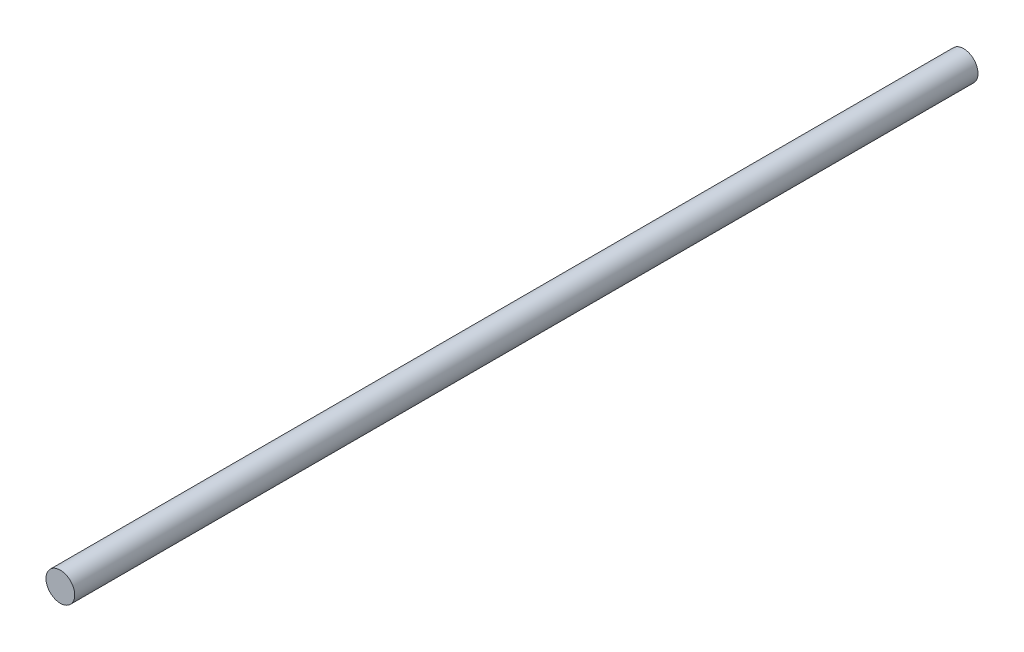
ISO-10303-21;
HEADER;
FILE_DESCRIPTION(('STEP AP214'),'2;1');
FILE_NAME('part.step','',(''),(''),'','','');
FILE_SCHEMA(('AUTOMOTIVE_DESIGN { 1 0 10303 214 1 1 1 1 }'));
ENDSEC;
DATA;
#1=APPLICATION_CONTEXT('core data for automotive mechanical design processes');
#2=APPLICATION_PROTOCOL_DEFINITION('international standard','automotive_design',2000,#1);
#3=PRODUCT_CONTEXT('',#1,'mechanical');
#4=PRODUCT('Part','Part','',(#3));
#5=PRODUCT_RELATED_PRODUCT_CATEGORY('part','',(#4));
#6=PRODUCT_DEFINITION_FORMATION('','',#4);
#7=PRODUCT_DEFINITION_CONTEXT('part definition',#1,'design');
#8=PRODUCT_DEFINITION('design','',#6,#7);
#9=PRODUCT_DEFINITION_SHAPE('','',#8);
#10=(LENGTH_UNIT() NAMED_UNIT(*) SI_UNIT(.MILLI.,.METRE.));
#11=(NAMED_UNIT(*) PLANE_ANGLE_UNIT() SI_UNIT($,.RADIAN.));
#12=(NAMED_UNIT(*) SI_UNIT($,.STERADIAN.) SOLID_ANGLE_UNIT());
#13=UNCERTAINTY_MEASURE_WITH_UNIT(LENGTH_MEASURE(1.E-05),#10,'distance_accuracy_value','');
#14=(GEOMETRIC_REPRESENTATION_CONTEXT(3) GLOBAL_UNCERTAINTY_ASSIGNED_CONTEXT((#13)) GLOBAL_UNIT_ASSIGNED_CONTEXT((#10,
#11,#12)) REPRESENTATION_CONTEXT('',''));
#15=CARTESIAN_POINT('',(0.,0.,0.));
#16=DIRECTION('',(0.,0.,1.));
#17=DIRECTION('',(1.,0.,0.));
#18=AXIS2_PLACEMENT_3D('',#15,#16,#17);
#19=CARTESIAN_POINT('',(0.,-0.5,-22.));
#20=DIRECTION('',(0.,0.,1.));
#21=DIRECTION('',(1.,0.,0.));
#22=AXIS2_PLACEMENT_3D('',#19,#20,#21);
#23=PLANE('',#22);
#24=CARTESIAN_POINT('',(0.,-0.5,-22.));
#25=DIRECTION('',(0.,0.,1.));
#26=DIRECTION('',(1.,0.,0.));
#27=AXIS2_PLACEMENT_3D('',#24,#25,#26);
#28=CIRCLE('',#27,0.35);
#29=CARTESIAN_POINT('',(0.35,-0.5,-22.));
#30=VERTEX_POINT('',#29);
#31=EDGE_CURVE('E18',#30,#30,#28,.T.);
#32=ORIENTED_EDGE('',*,*,#31,.F.);
#33=EDGE_LOOP('',(#32));
#34=FACE_BOUND('',#33,.T.);
#35=ADVANCED_FACE('F15',(#34),#23,.F.);
#36=CARTESIAN_POINT('',(0.,-0.5,0.));
#37=DIRECTION('',(0.,0.,1.));
#38=DIRECTION('',(1.,0.,0.));
#39=AXIS2_PLACEMENT_3D('',#36,#37,#38);
#40=PLANE('',#39);
#41=CARTESIAN_POINT('',(0.,-0.5,0.));
#42=DIRECTION('',(0.,0.,1.));
#43=DIRECTION('',(1.,0.,0.));
#44=AXIS2_PLACEMENT_3D('',#41,#42,#43);
#45=CIRCLE('',#44,0.35);
#46=CARTESIAN_POINT('',(0.35,-0.5,0.));
#47=VERTEX_POINT('',#46);
#48=EDGE_CURVE('E10',#47,#47,#45,.F.);
#49=ORIENTED_EDGE('',*,*,#48,.F.);
#50=EDGE_LOOP('',(#49));
#51=FACE_BOUND('',#50,.T.);
#52=ADVANCED_FACE('F30',(#51),#40,.T.);
#53=CARTESIAN_POINT('',(0.,-0.5,0.));
#54=DIRECTION('',(0.,0.,1.));
#55=DIRECTION('',(1.,0.,0.));
#56=AXIS2_PLACEMENT_3D('',#53,#54,#55);
#57=CYLINDRICAL_SURFACE('',#56,0.35);
#58=ORIENTED_EDGE('',*,*,#31,.T.);
#59=EDGE_LOOP('',(#58));
#60=FACE_BOUND('',#59,.T.);
#61=ORIENTED_EDGE('',*,*,#48,.T.);
#62=EDGE_LOOP('',(#61));
#63=FACE_BOUND('',#62,.T.);
#64=ADVANCED_FACE('F27',(#60,#63),#57,.T.);
#65=CLOSED_SHELL('',(#35,#52,#64));
#66=MANIFOLD_SOLID_BREP('B1',#65);
#67=ADVANCED_BREP_SHAPE_REPRESENTATION('',(#18,#66),#14);
#68=SHAPE_DEFINITION_REPRESENTATION(#9,#67);
ENDSEC;
END-ISO-10303-21;
